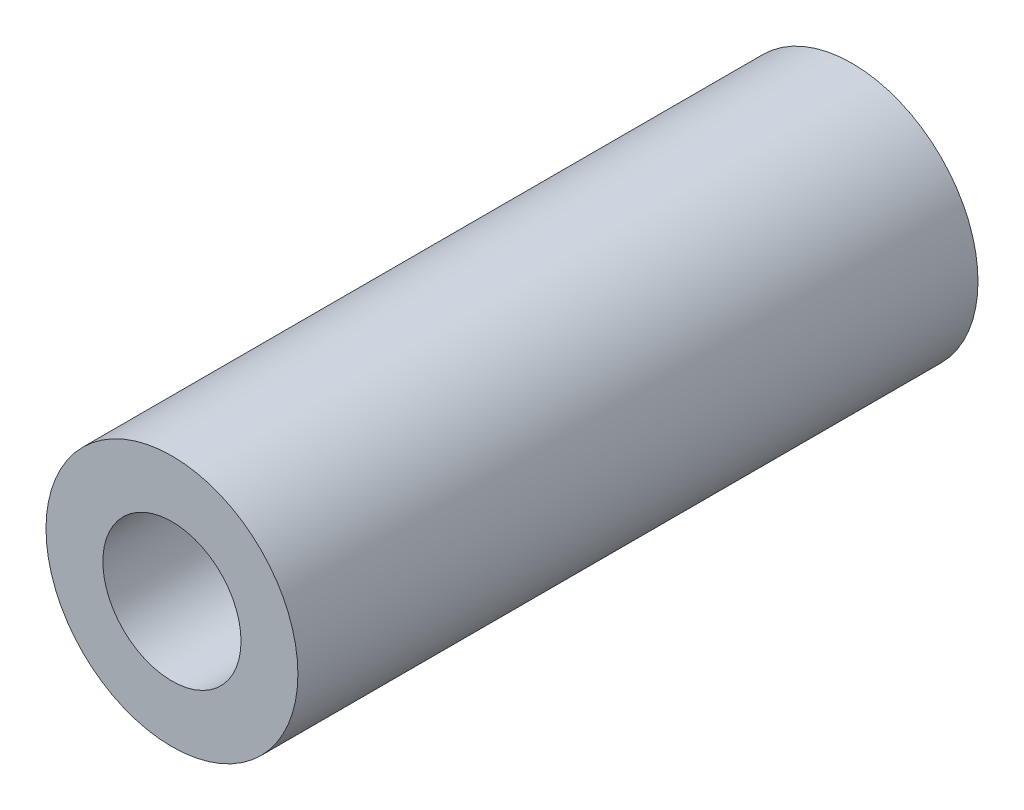
ISO-10303-21;
HEADER;
FILE_DESCRIPTION(('STEP AP214'),'2;1');
FILE_NAME('part.step','',(''),(''),'','','');
FILE_SCHEMA(('AUTOMOTIVE_DESIGN { 1 0 10303 214 1 1 1 1 }'));
ENDSEC;
DATA;
#1=APPLICATION_CONTEXT('core data for automotive mechanical design processes');
#2=APPLICATION_PROTOCOL_DEFINITION('international standard','automotive_design',2000,#1);
#3=PRODUCT_CONTEXT('',#1,'mechanical');
#4=PRODUCT('Part','Part','',(#3));
#5=PRODUCT_RELATED_PRODUCT_CATEGORY('part','',(#4));
#6=PRODUCT_DEFINITION_FORMATION('','',#4);
#7=PRODUCT_DEFINITION_CONTEXT('part definition',#1,'design');
#8=PRODUCT_DEFINITION('design','',#6,#7);
#9=PRODUCT_DEFINITION_SHAPE('','',#8);
#10=(LENGTH_UNIT() NAMED_UNIT(*) SI_UNIT(.MILLI.,.METRE.));
#11=(NAMED_UNIT(*) PLANE_ANGLE_UNIT() SI_UNIT($,.RADIAN.));
#12=(NAMED_UNIT(*) SI_UNIT($,.STERADIAN.) SOLID_ANGLE_UNIT());
#13=UNCERTAINTY_MEASURE_WITH_UNIT(LENGTH_MEASURE(1.E-05),#10,'distance_accuracy_value','');
#14=(GEOMETRIC_REPRESENTATION_CONTEXT(3) GLOBAL_UNCERTAINTY_ASSIGNED_CONTEXT((#13)) GLOBAL_UNIT_ASSIGNED_CONTEXT((#10,
#11,#12)) REPRESENTATION_CONTEXT('',''));
#15=CARTESIAN_POINT('',(0.,0.,0.));
#16=DIRECTION('',(0.,0.,1.));
#17=DIRECTION('',(1.,0.,0.));
#18=AXIS2_PLACEMENT_3D('',#15,#16,#17);
#19=CARTESIAN_POINT('',(16.0166666666667,16.0166666666667,16.74));
#20=DIRECTION('',(0.,0.,1.));
#21=DIRECTION('',(1.,0.,0.));
#22=AXIS2_PLACEMENT_3D('',#19,#20,#21);
#23=PLANE('',#22);
#24=CARTESIAN_POINT('',(16.0166666666667,16.0166666666667,16.74));
#25=DIRECTION('',(0.,0.,1.));
#26=DIRECTION('',(1.,0.,0.));
#27=AXIS2_PLACEMENT_3D('',#24,#25,#26);
#28=CIRCLE('',#27,1.7);
#29=CARTESIAN_POINT('',(17.7166666666667,16.0166666666667,16.74));
#30=VERTEX_POINT('',#29);
#31=EDGE_CURVE('E45',#30,#30,#28,.T.);
#32=ORIENTED_EDGE('',*,*,#31,.F.);
#33=EDGE_LOOP('',(#32));
#34=FACE_BOUND('',#33,.T.);
#35=CARTESIAN_POINT('',(16.0166666666667,16.0166666666667,16.74));
#36=DIRECTION('',(0.,0.,1.));
#37=DIRECTION('',(1.,0.,0.));
#38=AXIS2_PLACEMENT_3D('',#35,#36,#37);
#39=CIRCLE('',#38,3.1);
#40=CARTESIAN_POINT('',(19.1166666666667,16.0166666666667,16.74));
#41=VERTEX_POINT('',#40);
#42=EDGE_CURVE('E10',#41,#41,#39,.T.);
#43=ORIENTED_EDGE('',*,*,#42,.T.);
#44=EDGE_LOOP('',(#43));
#45=FACE_BOUND('',#44,.T.);
#46=ADVANCED_FACE('F30',(#34,#45),#23,.T.);
#47=CARTESIAN_POINT('',(16.0166666666667,16.0166666666667,0.));
#48=DIRECTION('',(0.,0.,1.));
#49=DIRECTION('',(1.,0.,0.));
#50=AXIS2_PLACEMENT_3D('',#47,#48,#49);
#51=PLANE('',#50);
#52=CARTESIAN_POINT('',(16.0166666666667,16.0166666666667,0.));
#53=DIRECTION('',(0.,0.,1.));
#54=DIRECTION('',(1.,0.,0.));
#55=AXIS2_PLACEMENT_3D('',#52,#53,#54);
#56=CIRCLE('',#55,1.7);
#57=CARTESIAN_POINT('',(17.7166666666667,16.0166666666667,0.));
#58=VERTEX_POINT('',#57);
#59=EDGE_CURVE('E41',#58,#58,#56,.T.);
#60=ORIENTED_EDGE('',*,*,#59,.T.);
#61=EDGE_LOOP('',(#60));
#62=FACE_BOUND('',#61,.T.);
#63=CARTESIAN_POINT('',(16.0166666666667,16.0166666666667,0.));
#64=DIRECTION('',(0.,0.,1.));
#65=DIRECTION('',(1.,0.,0.));
#66=AXIS2_PLACEMENT_3D('',#63,#64,#65);
#67=CIRCLE('',#66,3.1);
#68=CARTESIAN_POINT('',(19.1166666666667,16.0166666666667,0.));
#69=VERTEX_POINT('',#68);
#70=EDGE_CURVE('E34',#69,#69,#67,.T.);
#71=ORIENTED_EDGE('',*,*,#70,.F.);
#72=EDGE_LOOP('',(#71));
#73=FACE_BOUND('',#72,.T.);
#74=ADVANCED_FACE('F52',(#62,#73),#51,.F.);
#75=CARTESIAN_POINT('',(16.0166666666667,16.0166666666667,16.74));
#76=DIRECTION('',(0.,0.,-1.));
#77=DIRECTION('',(-1.,0.,0.));
#78=AXIS2_PLACEMENT_3D('',#75,#76,#77);
#79=CYLINDRICAL_SURFACE('',#78,3.1);
#80=ORIENTED_EDGE('',*,*,#42,.F.);
#81=EDGE_LOOP('',(#80));
#82=FACE_BOUND('',#81,.T.);
#83=ORIENTED_EDGE('',*,*,#70,.T.);
#84=EDGE_LOOP('',(#83));
#85=FACE_BOUND('',#84,.T.);
#86=ADVANCED_FACE('F32',(#82,#85),#79,.T.);
#87=CARTESIAN_POINT('',(16.0166666666667,16.0166666666667,16.74));
#88=DIRECTION('',(0.,0.,1.));
#89=DIRECTION('',(1.,0.,0.));
#90=AXIS2_PLACEMENT_3D('',#87,#88,#89);
#91=CYLINDRICAL_SURFACE('',#90,1.7);
#92=ORIENTED_EDGE('',*,*,#59,.F.);
#93=EDGE_LOOP('',(#92));
#94=FACE_BOUND('',#93,.T.);
#95=ORIENTED_EDGE('',*,*,#31,.T.);
#96=EDGE_LOOP('',(#95));
#97=FACE_BOUND('',#96,.T.);
#98=ADVANCED_FACE('F49',(#94,#97),#91,.F.);
#99=CLOSED_SHELL('',(#46,#74,#86,#98));
#100=MANIFOLD_SOLID_BREP('B2',#99);
#101=ADVANCED_BREP_SHAPE_REPRESENTATION('',(#18,#100),#14);
#102=SHAPE_DEFINITION_REPRESENTATION(#9,#101);
ENDSEC;
END-ISO-10303-21;
